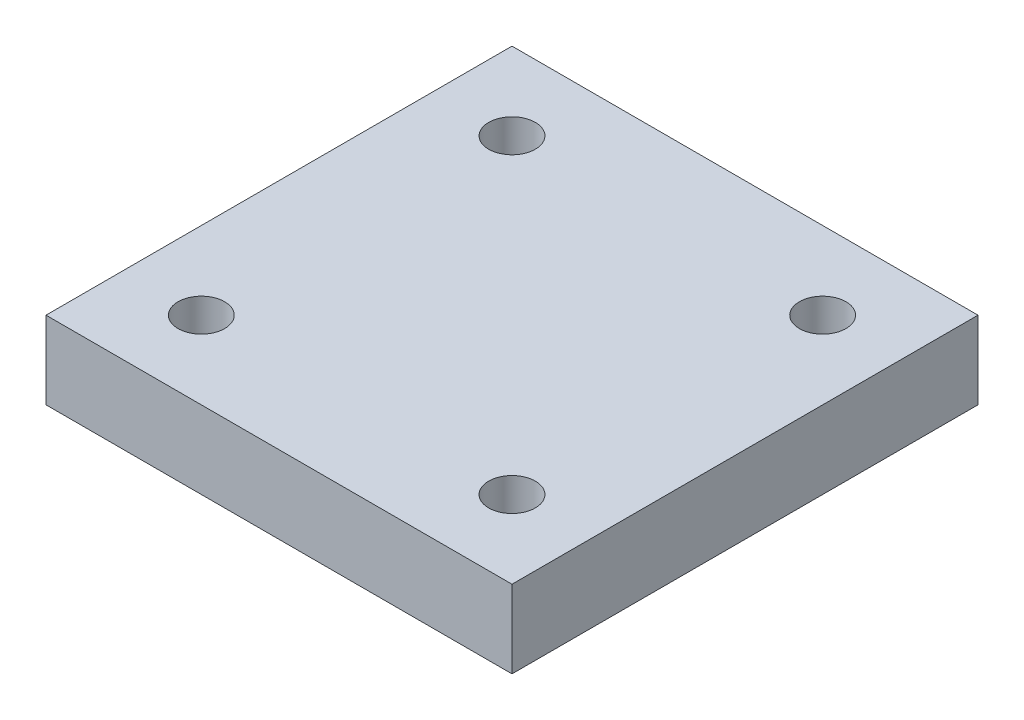
ISO-10303-21;
HEADER;
FILE_DESCRIPTION(('STEP AP214'),'2;1');
FILE_NAME('part.step','',(''),(''),'','','');
FILE_SCHEMA(('AUTOMOTIVE_DESIGN { 1 0 10303 214 1 1 1 1 }'));
ENDSEC;
DATA;
#1=APPLICATION_CONTEXT('core data for automotive mechanical design processes');
#2=APPLICATION_PROTOCOL_DEFINITION('international standard','automotive_design',2000,#1);
#3=PRODUCT_CONTEXT('',#1,'mechanical');
#4=PRODUCT('Part','Part','',(#3));
#5=PRODUCT_RELATED_PRODUCT_CATEGORY('part','',(#4));
#6=PRODUCT_DEFINITION_FORMATION('','',#4);
#7=PRODUCT_DEFINITION_CONTEXT('part definition',#1,'design');
#8=PRODUCT_DEFINITION('design','',#6,#7);
#9=PRODUCT_DEFINITION_SHAPE('','',#8);
#10=(LENGTH_UNIT() NAMED_UNIT(*) SI_UNIT(.MILLI.,.METRE.));
#11=(NAMED_UNIT(*) PLANE_ANGLE_UNIT() SI_UNIT($,.RADIAN.));
#12=(NAMED_UNIT(*) SI_UNIT($,.STERADIAN.) SOLID_ANGLE_UNIT());
#13=UNCERTAINTY_MEASURE_WITH_UNIT(LENGTH_MEASURE(1.E-05),#10,'distance_accuracy_value','');
#14=(GEOMETRIC_REPRESENTATION_CONTEXT(3) GLOBAL_UNCERTAINTY_ASSIGNED_CONTEXT((#13)) GLOBAL_UNIT_ASSIGNED_CONTEXT((#10,
#11,#12)) REPRESENTATION_CONTEXT('',''));
#15=CARTESIAN_POINT('',(0.,0.,0.));
#16=DIRECTION('',(0.,0.,1.));
#17=DIRECTION('',(1.,0.,0.));
#18=AXIS2_PLACEMENT_3D('',#15,#16,#17);
#19=CARTESIAN_POINT('',(0.,5.,0.));
#20=DIRECTION('',(0.,1.,0.));
#21=DIRECTION('',(0.,0.,1.));
#22=AXIS2_PLACEMENT_3D('',#19,#20,#21);
#23=PLANE('',#22);
#24=CARTESIAN_POINT('',(10.,5.,10.));
#25=DIRECTION('',(0.,1.,0.));
#26=DIRECTION('',(0.,0.,1.));
#27=AXIS2_PLACEMENT_3D('',#24,#25,#26);
#28=CIRCLE('',#27,1.5);
#29=CARTESIAN_POINT('',(10.,5.,11.5));
#30=VERTEX_POINT('',#29);
#31=EDGE_CURVE('E127',#30,#30,#28,.T.);
#32=ORIENTED_EDGE('',*,*,#31,.F.);
#33=EDGE_LOOP('',(#32));
#34=FACE_BOUND('',#33,.T.);
#35=CARTESIAN_POINT('',(-10.,5.,-10.));
#36=DIRECTION('',(0.,1.,0.));
#37=DIRECTION('',(0.,0.,1.));
#38=AXIS2_PLACEMENT_3D('',#35,#36,#37);
#39=CIRCLE('',#38,1.5);
#40=CARTESIAN_POINT('',(-10.,5.,-8.5));
#41=VERTEX_POINT('',#40);
#42=EDGE_CURVE('E106',#41,#41,#39,.T.);
#43=ORIENTED_EDGE('',*,*,#42,.F.);
#44=EDGE_LOOP('',(#43));
#45=FACE_BOUND('',#44,.T.);
#46=DIRECTION('',(0.,0.,1.));
#47=VECTOR('',#46,1.);
#48=CARTESIAN_POINT('',(-15.,5.,15.));
#49=LINE('',#48,#47);
#50=CARTESIAN_POINT('',(-15.,5.,-15.));
#51=VERTEX_POINT('',#50);
#52=CARTESIAN_POINT('',(-15.,5.,15.));
#53=VERTEX_POINT('',#52);
#54=EDGE_CURVE('E91',#51,#53,#49,.T.);
#55=ORIENTED_EDGE('',*,*,#54,.T.);
#56=DIRECTION('',(1.,0.,0.));
#57=VECTOR('',#56,1.);
#58=CARTESIAN_POINT('',(15.,5.,15.));
#59=LINE('',#58,#57);
#60=CARTESIAN_POINT('',(15.,5.,15.));
#61=VERTEX_POINT('',#60);
#62=EDGE_CURVE('E86',#53,#61,#59,.T.);
#63=ORIENTED_EDGE('',*,*,#62,.T.);
#64=DIRECTION('',(0.,0.,-1.));
#65=VECTOR('',#64,1.);
#66=CARTESIAN_POINT('',(15.,5.,15.));
#67=LINE('',#66,#65);
#68=CARTESIAN_POINT('',(15.,5.,-15.));
#69=VERTEX_POINT('',#68);
#70=EDGE_CURVE('E89',#61,#69,#67,.T.);
#71=ORIENTED_EDGE('',*,*,#70,.T.);
#72=DIRECTION('',(-1.,0.,0.));
#73=VECTOR('',#72,1.);
#74=CARTESIAN_POINT('',(15.,5.,-15.));
#75=LINE('',#74,#73);
#76=EDGE_CURVE('E56',#69,#51,#75,.T.);
#77=ORIENTED_EDGE('',*,*,#76,.T.);
#78=EDGE_LOOP('',(#55,#63,#71,#77));
#79=FACE_BOUND('',#78,.T.);
#80=CARTESIAN_POINT('',(10.,5.,-10.));
#81=DIRECTION('',(0.,1.,0.));
#82=DIRECTION('',(0.,0.,-1.));
#83=AXIS2_PLACEMENT_3D('',#80,#81,#82);
#84=CIRCLE('',#83,1.5);
#85=CARTESIAN_POINT('',(10.,5.,-11.5));
#86=VERTEX_POINT('',#85);
#87=EDGE_CURVE('E121',#86,#86,#84,.T.);
#88=ORIENTED_EDGE('',*,*,#87,.F.);
#89=EDGE_LOOP('',(#88));
#90=FACE_BOUND('',#89,.T.);
#91=CARTESIAN_POINT('',(-10.,5.,10.));
#92=DIRECTION('',(0.,1.,0.));
#93=DIRECTION('',(0.,0.,-1.));
#94=AXIS2_PLACEMENT_3D('',#91,#92,#93);
#95=CIRCLE('',#94,1.5);
#96=CARTESIAN_POINT('',(-10.,5.,8.5));
#97=VERTEX_POINT('',#96);
#98=EDGE_CURVE('E133',#97,#97,#95,.T.);
#99=ORIENTED_EDGE('',*,*,#98,.F.);
#100=EDGE_LOOP('',(#99));
#101=FACE_BOUND('',#100,.T.);
#102=ADVANCED_FACE('F39',(#34,#45,#79,#90,#101),#23,.T.);
#103=CARTESIAN_POINT('',(0.,0.,0.));
#104=DIRECTION('',(0.,1.,0.));
#105=DIRECTION('',(0.,0.,1.));
#106=AXIS2_PLACEMENT_3D('',#103,#104,#105);
#107=PLANE('',#106);
#108=DIRECTION('',(0.,0.,1.));
#109=VECTOR('',#108,1.);
#110=CARTESIAN_POINT('',(-15.,0.,15.));
#111=LINE('',#110,#109);
#112=CARTESIAN_POINT('',(-15.,0.,-15.));
#113=VERTEX_POINT('',#112);
#114=CARTESIAN_POINT('',(-15.,0.,15.));
#115=VERTEX_POINT('',#114);
#116=EDGE_CURVE('E103',#113,#115,#111,.T.);
#117=ORIENTED_EDGE('',*,*,#116,.F.);
#118=DIRECTION('',(-1.,0.,0.));
#119=VECTOR('',#118,1.);
#120=CARTESIAN_POINT('',(15.,0.,-15.));
#121=LINE('',#120,#119);
#122=CARTESIAN_POINT('',(15.,0.,-15.));
#123=VERTEX_POINT('',#122);
#124=EDGE_CURVE('E79',#123,#113,#121,.T.);
#125=ORIENTED_EDGE('',*,*,#124,.F.);
#126=DIRECTION('',(0.,0.,-1.));
#127=VECTOR('',#126,1.);
#128=CARTESIAN_POINT('',(15.,0.,15.));
#129=LINE('',#128,#127);
#130=CARTESIAN_POINT('',(15.,0.,15.));
#131=VERTEX_POINT('',#130);
#132=EDGE_CURVE('E73',#131,#123,#129,.T.);
#133=ORIENTED_EDGE('',*,*,#132,.F.);
#134=DIRECTION('',(1.,0.,0.));
#135=VECTOR('',#134,1.);
#136=CARTESIAN_POINT('',(15.,0.,15.));
#137=LINE('',#136,#135);
#138=EDGE_CURVE('E95',#115,#131,#137,.T.);
#139=ORIENTED_EDGE('',*,*,#138,.F.);
#140=EDGE_LOOP('',(#117,#125,#133,#139));
#141=FACE_BOUND('',#140,.T.);
#142=CARTESIAN_POINT('',(-10.,0.,-10.));
#143=DIRECTION('',(0.,1.,0.));
#144=DIRECTION('',(0.,0.,1.));
#145=AXIS2_PLACEMENT_3D('',#142,#143,#144);
#146=CIRCLE('',#145,1.5);
#147=CARTESIAN_POINT('',(-10.,0.,-8.5));
#148=VERTEX_POINT('',#147);
#149=EDGE_CURVE('E118',#148,#148,#146,.T.);
#150=ORIENTED_EDGE('',*,*,#149,.T.);
#151=EDGE_LOOP('',(#150));
#152=FACE_BOUND('',#151,.T.);
#153=CARTESIAN_POINT('',(10.,0.,-10.));
#154=DIRECTION('',(0.,1.,0.));
#155=DIRECTION('',(0.,0.,-1.));
#156=AXIS2_PLACEMENT_3D('',#153,#154,#155);
#157=CIRCLE('',#156,1.5);
#158=CARTESIAN_POINT('',(10.,0.,-11.5));
#159=VERTEX_POINT('',#158);
#160=EDGE_CURVE('E124',#159,#159,#157,.T.);
#161=ORIENTED_EDGE('',*,*,#160,.T.);
#162=EDGE_LOOP('',(#161));
#163=FACE_BOUND('',#162,.T.);
#164=CARTESIAN_POINT('',(10.,0.,10.));
#165=DIRECTION('',(0.,1.,0.));
#166=DIRECTION('',(0.,0.,1.));
#167=AXIS2_PLACEMENT_3D('',#164,#165,#166);
#168=CIRCLE('',#167,1.5);
#169=CARTESIAN_POINT('',(10.,0.,11.5));
#170=VERTEX_POINT('',#169);
#171=EDGE_CURVE('E130',#170,#170,#168,.T.);
#172=ORIENTED_EDGE('',*,*,#171,.T.);
#173=EDGE_LOOP('',(#172));
#174=FACE_BOUND('',#173,.T.);
#175=CARTESIAN_POINT('',(-10.,0.,10.));
#176=DIRECTION('',(0.,1.,0.));
#177=DIRECTION('',(0.,0.,-1.));
#178=AXIS2_PLACEMENT_3D('',#175,#176,#177);
#179=CIRCLE('',#178,1.5);
#180=CARTESIAN_POINT('',(-10.,0.,8.5));
#181=VERTEX_POINT('',#180);
#182=EDGE_CURVE('E136',#181,#181,#179,.T.);
#183=ORIENTED_EDGE('',*,*,#182,.T.);
#184=EDGE_LOOP('',(#183));
#185=FACE_BOUND('',#184,.T.);
#186=ADVANCED_FACE('F114',(#141,#152,#163,#174,#185),#107,.F.);
#187=CARTESIAN_POINT('',(-15.,5.,15.));
#188=DIRECTION('',(1.,0.,0.));
#189=DIRECTION('',(0.,0.,-1.));
#190=AXIS2_PLACEMENT_3D('',#187,#188,#189);
#191=PLANE('',#190);
#192=ORIENTED_EDGE('',*,*,#116,.T.);
#193=DIRECTION('',(0.,-1.,0.));
#194=VECTOR('',#193,1.);
#195=CARTESIAN_POINT('',(-15.,5.,15.));
#196=LINE('',#195,#194);
#197=EDGE_CURVE('E11',#53,#115,#196,.T.);
#198=ORIENTED_EDGE('',*,*,#197,.F.);
#199=ORIENTED_EDGE('',*,*,#54,.F.);
#200=DIRECTION('',(0.,-1.,0.));
#201=VECTOR('',#200,1.);
#202=CARTESIAN_POINT('',(-15.,5.,-15.));
#203=LINE('',#202,#201);
#204=EDGE_CURVE('E99',#51,#113,#203,.T.);
#205=ORIENTED_EDGE('',*,*,#204,.T.);
#206=EDGE_LOOP('',(#192,#198,#199,#205));
#207=FACE_BOUND('',#206,.T.);
#208=ADVANCED_FACE('F41',(#207),#191,.F.);
#209=CARTESIAN_POINT('',(15.,5.,15.));
#210=DIRECTION('',(0.,0.,-1.));
#211=DIRECTION('',(-1.,0.,0.));
#212=AXIS2_PLACEMENT_3D('',#209,#210,#211);
#213=PLANE('',#212);
#214=ORIENTED_EDGE('',*,*,#138,.T.);
#215=DIRECTION('',(0.,-1.,0.));
#216=VECTOR('',#215,1.);
#217=CARTESIAN_POINT('',(15.,5.,15.));
#218=LINE('',#217,#216);
#219=EDGE_CURVE('E48',#61,#131,#218,.T.);
#220=ORIENTED_EDGE('',*,*,#219,.F.);
#221=ORIENTED_EDGE('',*,*,#62,.F.);
#222=ORIENTED_EDGE('',*,*,#197,.T.);
#223=EDGE_LOOP('',(#214,#220,#221,#222));
#224=FACE_BOUND('',#223,.T.);
#225=ADVANCED_FACE('F94',(#224),#213,.F.);
#226=CARTESIAN_POINT('',(15.,5.,15.));
#227=DIRECTION('',(-1.,0.,0.));
#228=DIRECTION('',(0.,0.,1.));
#229=AXIS2_PLACEMENT_3D('',#226,#227,#228);
#230=PLANE('',#229);
#231=ORIENTED_EDGE('',*,*,#132,.T.);
#232=DIRECTION('',(0.,-1.,0.));
#233=VECTOR('',#232,1.);
#234=CARTESIAN_POINT('',(15.,5.,-15.));
#235=LINE('',#234,#233);
#236=EDGE_CURVE('E96',#69,#123,#235,.T.);
#237=ORIENTED_EDGE('',*,*,#236,.F.);
#238=ORIENTED_EDGE('',*,*,#70,.F.);
#239=ORIENTED_EDGE('',*,*,#219,.T.);
#240=EDGE_LOOP('',(#231,#237,#238,#239));
#241=FACE_BOUND('',#240,.T.);
#242=ADVANCED_FACE('F97',(#241),#230,.F.);
#243=CARTESIAN_POINT('',(15.,5.,-15.));
#244=DIRECTION('',(0.,0.,1.));
#245=DIRECTION('',(1.,0.,0.));
#246=AXIS2_PLACEMENT_3D('',#243,#244,#245);
#247=PLANE('',#246);
#248=ORIENTED_EDGE('',*,*,#124,.T.);
#249=ORIENTED_EDGE('',*,*,#204,.F.);
#250=ORIENTED_EDGE('',*,*,#76,.F.);
#251=ORIENTED_EDGE('',*,*,#236,.T.);
#252=EDGE_LOOP('',(#248,#249,#250,#251));
#253=FACE_BOUND('',#252,.T.);
#254=ADVANCED_FACE('F111',(#253),#247,.F.);
#255=CARTESIAN_POINT('',(-10.,5.,-10.));
#256=DIRECTION('',(0.,-1.,0.));
#257=DIRECTION('',(0.,0.,-1.));
#258=AXIS2_PLACEMENT_3D('',#255,#256,#257);
#259=CYLINDRICAL_SURFACE('',#258,1.5);
#260=ORIENTED_EDGE('',*,*,#42,.T.);
#261=EDGE_LOOP('',(#260));
#262=FACE_BOUND('',#261,.T.);
#263=ORIENTED_EDGE('',*,*,#149,.F.);
#264=EDGE_LOOP('',(#263));
#265=FACE_BOUND('',#264,.T.);
#266=ADVANCED_FACE('F155',(#262,#265),#259,.F.);
#267=CARTESIAN_POINT('',(10.,5.,-10.));
#268=DIRECTION('',(0.,-1.,0.));
#269=DIRECTION('',(0.,0.,-1.));
#270=AXIS2_PLACEMENT_3D('',#267,#268,#269);
#271=CYLINDRICAL_SURFACE('',#270,1.5);
#272=ORIENTED_EDGE('',*,*,#87,.T.);
#273=EDGE_LOOP('',(#272));
#274=FACE_BOUND('',#273,.T.);
#275=ORIENTED_EDGE('',*,*,#160,.F.);
#276=EDGE_LOOP('',(#275));
#277=FACE_BOUND('',#276,.T.);
#278=ADVANCED_FACE('F200',(#274,#277),#271,.F.);
#279=CARTESIAN_POINT('',(10.,5.,10.));
#280=DIRECTION('',(0.,-1.,0.));
#281=DIRECTION('',(0.,0.,-1.));
#282=AXIS2_PLACEMENT_3D('',#279,#280,#281);
#283=CYLINDRICAL_SURFACE('',#282,1.5);
#284=ORIENTED_EDGE('',*,*,#31,.T.);
#285=EDGE_LOOP('',(#284));
#286=FACE_BOUND('',#285,.T.);
#287=ORIENTED_EDGE('',*,*,#171,.F.);
#288=EDGE_LOOP('',(#287));
#289=FACE_BOUND('',#288,.T.);
#290=ADVANCED_FACE('F208',(#286,#289),#283,.F.);
#291=CARTESIAN_POINT('',(-10.,5.,10.));
#292=DIRECTION('',(0.,-1.,0.));
#293=DIRECTION('',(0.,0.,-1.));
#294=AXIS2_PLACEMENT_3D('',#291,#292,#293);
#295=CYLINDRICAL_SURFACE('',#294,1.5);
#296=ORIENTED_EDGE('',*,*,#98,.T.);
#297=EDGE_LOOP('',(#296));
#298=FACE_BOUND('',#297,.T.);
#299=ORIENTED_EDGE('',*,*,#182,.F.);
#300=EDGE_LOOP('',(#299));
#301=FACE_BOUND('',#300,.T.);
#302=ADVANCED_FACE('F142',(#298,#301),#295,.F.);
#303=CLOSED_SHELL('',(#102,#186,#208,#225,#242,#254,#266,#278,#290,#302));
#304=MANIFOLD_SOLID_BREP('B2',#303);
#305=ADVANCED_BREP_SHAPE_REPRESENTATION('',(#18,#304),#14);
#306=SHAPE_DEFINITION_REPRESENTATION(#9,#305);
ENDSEC;
END-ISO-10303-21;
